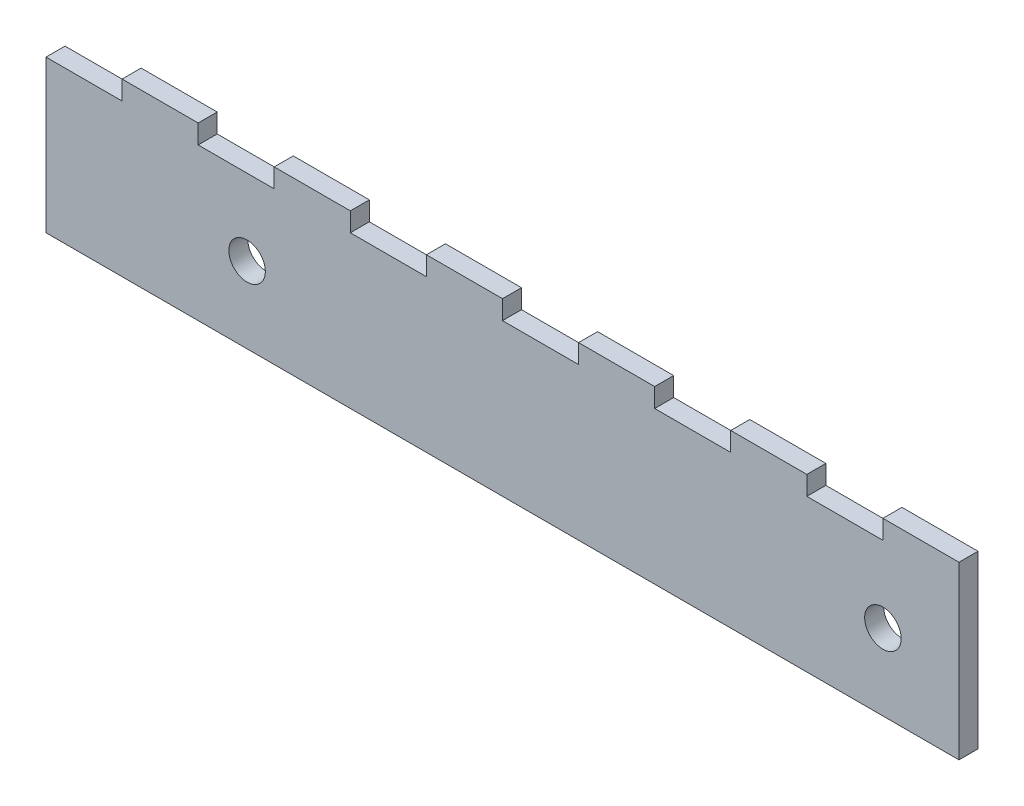
ISO-10303-21;
HEADER;
FILE_DESCRIPTION(('STEP AP214'),'2;1');
FILE_NAME('part.step','',(''),(''),'','','');
FILE_SCHEMA(('AUTOMOTIVE_DESIGN { 1 0 10303 214 1 1 1 1 }'));
ENDSEC;
DATA;
#1=APPLICATION_CONTEXT('core data for automotive mechanical design processes');
#2=APPLICATION_PROTOCOL_DEFINITION('international standard','automotive_design',2000,#1);
#3=PRODUCT_CONTEXT('',#1,'mechanical');
#4=PRODUCT('Part','Part','',(#3));
#5=PRODUCT_RELATED_PRODUCT_CATEGORY('part','',(#4));
#6=PRODUCT_DEFINITION_FORMATION('','',#4);
#7=PRODUCT_DEFINITION_CONTEXT('part definition',#1,'design');
#8=PRODUCT_DEFINITION('design','',#6,#7);
#9=PRODUCT_DEFINITION_SHAPE('','',#8);
#10=(LENGTH_UNIT() NAMED_UNIT(*) SI_UNIT(.MILLI.,.METRE.));
#11=(NAMED_UNIT(*) PLANE_ANGLE_UNIT() SI_UNIT($,.RADIAN.));
#12=(NAMED_UNIT(*) SI_UNIT($,.STERADIAN.) SOLID_ANGLE_UNIT());
#13=UNCERTAINTY_MEASURE_WITH_UNIT(LENGTH_MEASURE(1.E-05),#10,'distance_accuracy_value','');
#14=(GEOMETRIC_REPRESENTATION_CONTEXT(3) GLOBAL_UNCERTAINTY_ASSIGNED_CONTEXT((#13)) GLOBAL_UNIT_ASSIGNED_CONTEXT((#10,
#11,#12)) REPRESENTATION_CONTEXT('',''));
#15=CARTESIAN_POINT('',(0.,0.,0.));
#16=DIRECTION('',(0.,0.,1.));
#17=DIRECTION('',(1.,0.,0.));
#18=AXIS2_PLACEMENT_3D('',#15,#16,#17);
#19=CARTESIAN_POINT('',(0.,25.4,3.175));
#20=DIRECTION('',(0.,-1.,0.));
#21=DIRECTION('',(0.,0.,-1.));
#22=AXIS2_PLACEMENT_3D('',#19,#20,#21);
#23=PLANE('',#22);
#24=DIRECTION('',(0.,0.,1.));
#25=VECTOR('',#24,1.);
#26=CARTESIAN_POINT('',(12.7,25.4,8.88391561501073E-13));
#27=LINE('',#26,#25);
#28=CARTESIAN_POINT('',(12.7,25.4,8.88391561501073E-13));
#29=VERTEX_POINT('',#28);
#30=CARTESIAN_POINT('',(12.7,25.4,3.175));
#31=VERTEX_POINT('',#30);
#32=EDGE_CURVE('E425',#29,#31,#27,.T.);
#33=ORIENTED_EDGE('',*,*,#32,.F.);
#34=DIRECTION('',(-1.,0.,0.));
#35=VECTOR('',#34,1.);
#36=CARTESIAN_POINT('',(0.,25.4,0.));
#37=LINE('',#36,#35);
#38=CARTESIAN_POINT('',(0.,25.4,0.));
#39=VERTEX_POINT('',#38);
#40=EDGE_CURVE('E234',#29,#39,#37,.T.);
#41=ORIENTED_EDGE('',*,*,#40,.T.);
#42=DIRECTION('',(0.,0.,-1.));
#43=VECTOR('',#42,1.);
#44=CARTESIAN_POINT('',(0.,25.4,3.175));
#45=LINE('',#44,#43);
#46=CARTESIAN_POINT('',(0.,25.4,3.175));
#47=VERTEX_POINT('',#46);
#48=EDGE_CURVE('E391',#47,#39,#45,.T.);
#49=ORIENTED_EDGE('',*,*,#48,.F.);
#50=DIRECTION('',(-1.,0.,0.));
#51=VECTOR('',#50,1.);
#52=CARTESIAN_POINT('',(0.,25.4,3.175));
#53=LINE('',#52,#51);
#54=EDGE_CURVE('E52',#31,#47,#53,.T.);
#55=ORIENTED_EDGE('',*,*,#54,.F.);
#56=EDGE_LOOP('',(#33,#41,#49,#55));
#57=FACE_BOUND('',#56,.T.);
#58=ADVANCED_FACE('F37',(#57),#23,.F.);
#59=DIRECTION('',(0.,0.,-1.));
#60=VECTOR('',#59,1.);
#61=CARTESIAN_POINT('',(25.4,25.4,8.86836260066156E-13));
#62=LINE('',#61,#60);
#63=CARTESIAN_POINT('',(25.4,25.4,3.175));
#64=VERTEX_POINT('',#63);
#65=CARTESIAN_POINT('',(25.4,25.4,0.));
#66=VERTEX_POINT('',#65);
#67=EDGE_CURVE('E60',#64,#66,#62,.T.);
#68=ORIENTED_EDGE('',*,*,#67,.F.);
#69=CARTESIAN_POINT('',(38.1,25.4,3.175));
#70=VERTEX_POINT('',#69);
#71=EDGE_CURVE('E457',#70,#64,#53,.T.);
#72=ORIENTED_EDGE('',*,*,#71,.F.);
#73=DIRECTION('',(0.,0.,1.));
#74=VECTOR('',#73,1.);
#75=CARTESIAN_POINT('',(38.1,25.4,7.11024309487842E-13));
#76=LINE('',#75,#74);
#77=CARTESIAN_POINT('',(38.1,25.4,7.11024309487842E-13));
#78=VERTEX_POINT('',#77);
#79=EDGE_CURVE('E235',#78,#70,#76,.T.);
#80=ORIENTED_EDGE('',*,*,#79,.F.);
#81=EDGE_CURVE('E426',#78,#66,#37,.T.);
#82=ORIENTED_EDGE('',*,*,#81,.T.);
#83=EDGE_LOOP('',(#68,#72,#80,#82));
#84=FACE_BOUND('',#83,.T.);
#85=ADVANCED_FACE('F471',(#84),#23,.F.);
#86=DIRECTION('',(0.,0.,-1.));
#87=VECTOR('',#86,1.);
#88=CARTESIAN_POINT('',(50.8,25.4,7.09469008052925E-13));
#89=LINE('',#88,#87);
#90=CARTESIAN_POINT('',(50.8,25.4,3.175));
#91=VERTEX_POINT('',#90);
#92=CARTESIAN_POINT('',(50.8,25.4,0.));
#93=VERTEX_POINT('',#92);
#94=EDGE_CURVE('E238',#91,#93,#89,.T.);
#95=ORIENTED_EDGE('',*,*,#94,.F.);
#96=CARTESIAN_POINT('',(63.5,25.4,3.175));
#97=VERTEX_POINT('',#96);
#98=EDGE_CURVE('E454',#97,#91,#53,.T.);
#99=ORIENTED_EDGE('',*,*,#98,.F.);
#100=DIRECTION('',(0.,0.,1.));
#101=VECTOR('',#100,1.);
#102=CARTESIAN_POINT('',(63.5,25.4,5.33657057474611E-13));
#103=LINE('',#102,#101);
#104=CARTESIAN_POINT('',(63.5,25.4,5.33657057474611E-13));
#105=VERTEX_POINT('',#104);
#106=EDGE_CURVE('E267',#105,#97,#103,.T.);
#107=ORIENTED_EDGE('',*,*,#106,.F.);
#108=EDGE_CURVE('E427',#105,#93,#37,.T.);
#109=ORIENTED_EDGE('',*,*,#108,.T.);
#110=EDGE_LOOP('',(#95,#99,#107,#109));
#111=FACE_BOUND('',#110,.T.);
#112=ADVANCED_FACE('F483',(#111),#23,.F.);
#113=DIRECTION('',(0.,0.,-1.));
#114=VECTOR('',#113,1.);
#115=CARTESIAN_POINT('',(76.2,25.4,5.32101756039693E-13));
#116=LINE('',#115,#114);
#117=CARTESIAN_POINT('',(76.2,25.4,3.175));
#118=VERTEX_POINT('',#117);
#119=CARTESIAN_POINT('',(76.2,25.4,0.));
#120=VERTEX_POINT('',#119);
#121=EDGE_CURVE('E272',#118,#120,#116,.T.);
#122=ORIENTED_EDGE('',*,*,#121,.F.);
#123=CARTESIAN_POINT('',(88.9,25.4,3.175));
#124=VERTEX_POINT('',#123);
#125=EDGE_CURVE('E452',#124,#118,#53,.T.);
#126=ORIENTED_EDGE('',*,*,#125,.F.);
#127=DIRECTION('',(0.,0.,1.));
#128=VECTOR('',#127,1.);
#129=CARTESIAN_POINT('',(88.9,25.4,3.56289805461379E-13));
#130=LINE('',#129,#128);
#131=CARTESIAN_POINT('',(88.9,25.4,3.56289805461379E-13));
#132=VERTEX_POINT('',#131);
#133=EDGE_CURVE('E294',#132,#124,#130,.T.);
#134=ORIENTED_EDGE('',*,*,#133,.F.);
#135=EDGE_CURVE('E429',#132,#120,#37,.T.);
#136=ORIENTED_EDGE('',*,*,#135,.T.);
#137=EDGE_LOOP('',(#122,#126,#134,#136));
#138=FACE_BOUND('',#137,.T.);
#139=ADVANCED_FACE('F495',(#138),#23,.F.);
#140=DIRECTION('',(0.,0.,-1.));
#141=VECTOR('',#140,1.);
#142=CARTESIAN_POINT('',(101.6,25.4,3.54734504026462E-13));
#143=LINE('',#142,#141);
#144=CARTESIAN_POINT('',(101.6,25.4,3.175));
#145=VERTEX_POINT('',#144);
#146=CARTESIAN_POINT('',(101.6,25.4,0.));
#147=VERTEX_POINT('',#146);
#148=EDGE_CURVE('E299',#145,#147,#143,.T.);
#149=ORIENTED_EDGE('',*,*,#148,.F.);
#150=CARTESIAN_POINT('',(114.3,25.4,3.175));
#151=VERTEX_POINT('',#150);
#152=EDGE_CURVE('E392',#151,#145,#53,.T.);
#153=ORIENTED_EDGE('',*,*,#152,.F.);
#154=DIRECTION('',(0.,0.,1.));
#155=VECTOR('',#154,1.);
#156=CARTESIAN_POINT('',(114.3,25.4,1.78922553448148E-13));
#157=LINE('',#156,#155);
#158=CARTESIAN_POINT('',(114.3,25.4,1.78922553448148E-13));
#159=VERTEX_POINT('',#158);
#160=EDGE_CURVE('E321',#159,#151,#157,.T.);
#161=ORIENTED_EDGE('',*,*,#160,.F.);
#162=EDGE_CURVE('E400',#159,#147,#37,.T.);
#163=ORIENTED_EDGE('',*,*,#162,.T.);
#164=EDGE_LOOP('',(#149,#153,#161,#163));
#165=FACE_BOUND('',#164,.T.);
#166=ADVANCED_FACE('F436',(#165),#23,.F.);
#167=DIRECTION('',(0.,0.,-1.));
#168=VECTOR('',#167,1.);
#169=CARTESIAN_POINT('',(127.,25.4,1.77367252013231E-13));
#170=LINE('',#169,#168);
#171=CARTESIAN_POINT('',(127.,25.4,3.175));
#172=VERTEX_POINT('',#171);
#173=CARTESIAN_POINT('',(127.,25.4,0.));
#174=VERTEX_POINT('',#173);
#175=EDGE_CURVE('E326',#172,#174,#170,.T.);
#176=ORIENTED_EDGE('',*,*,#175,.F.);
#177=CARTESIAN_POINT('',(139.7,25.4,3.175));
#178=VERTEX_POINT('',#177);
#179=EDGE_CURVE('E388',#178,#172,#53,.T.);
#180=ORIENTED_EDGE('',*,*,#179,.F.);
#181=DIRECTION('',(0.,0.,1.));
#182=VECTOR('',#181,1.);
#183=CARTESIAN_POINT('',(139.7,25.4,0.));
#184=LINE('',#183,#182);
#185=CARTESIAN_POINT('',(139.7,25.4,0.));
#186=VERTEX_POINT('',#185);
#187=EDGE_CURVE('E348',#186,#178,#184,.T.);
#188=ORIENTED_EDGE('',*,*,#187,.F.);
#189=EDGE_CURVE('E384',#186,#174,#37,.T.);
#190=ORIENTED_EDGE('',*,*,#189,.T.);
#191=EDGE_LOOP('',(#176,#180,#188,#190));
#192=FACE_BOUND('',#191,.T.);
#193=ADVANCED_FACE('F511',(#192),#23,.F.);
#194=CARTESIAN_POINT('',(0.,0.,3.175));
#195=DIRECTION('',(0.,0.,-1.));
#196=DIRECTION('',(-1.,0.,0.));
#197=AXIS2_PLACEMENT_3D('',#194,#195,#196);
#198=PLANE('',#197);
#199=DIRECTION('',(0.,-1.,0.));
#200=VECTOR('',#199,1.);
#201=CARTESIAN_POINT('',(0.,0.,3.175));
#202=LINE('',#201,#200);
#203=CARTESIAN_POINT('',(0.,0.,3.175));
#204=VERTEX_POINT('',#203);
#205=EDGE_CURVE('E380',#47,#204,#202,.T.);
#206=ORIENTED_EDGE('',*,*,#205,.T.);
#207=DIRECTION('',(1.,0.,0.));
#208=VECTOR('',#207,1.);
#209=CARTESIAN_POINT('',(0.,0.,3.175));
#210=LINE('',#209,#208);
#211=CARTESIAN_POINT('',(152.4,0.,3.175));
#212=VERTEX_POINT('',#211);
#213=EDGE_CURVE('E383',#204,#212,#210,.T.);
#214=ORIENTED_EDGE('',*,*,#213,.T.);
#215=DIRECTION('',(0.,1.,0.));
#216=VECTOR('',#215,1.);
#217=CARTESIAN_POINT('',(152.4,0.,3.175));
#218=LINE('',#217,#216);
#219=CARTESIAN_POINT('',(152.4,28.575,3.175));
#220=VERTEX_POINT('',#219);
#221=EDGE_CURVE('E386',#212,#220,#218,.T.);
#222=ORIENTED_EDGE('',*,*,#221,.T.);
#223=DIRECTION('',(1.,0.,0.));
#224=VECTOR('',#223,1.);
#225=CARTESIAN_POINT('',(152.4,28.575,3.175));
#226=LINE('',#225,#224);
#227=CARTESIAN_POINT('',(139.7,28.575,3.175));
#228=VERTEX_POINT('',#227);
#229=EDGE_CURVE('E356',#228,#220,#226,.T.);
#230=ORIENTED_EDGE('',*,*,#229,.F.);
#231=DIRECTION('',(0.,-1.,0.));
#232=VECTOR('',#231,1.);
#233=CARTESIAN_POINT('',(139.7,28.575,3.175));
#234=LINE('',#233,#232);
#235=EDGE_CURVE('E359',#228,#178,#234,.T.);
#236=ORIENTED_EDGE('',*,*,#235,.T.);
#237=ORIENTED_EDGE('',*,*,#179,.T.);
#238=DIRECTION('',(0.,-1.,0.));
#239=VECTOR('',#238,1.);
#240=CARTESIAN_POINT('',(127.,28.575,3.17500000000018));
#241=LINE('',#240,#239);
#242=CARTESIAN_POINT('',(127.,28.575,3.17500000000018));
#243=VERTEX_POINT('',#242);
#244=EDGE_CURVE('E339',#243,#172,#241,.T.);
#245=ORIENTED_EDGE('',*,*,#244,.F.);
#246=DIRECTION('',(1.,0.,0.));
#247=VECTOR('',#246,1.);
#248=CARTESIAN_POINT('',(127.,28.575,3.17500000000018));
#249=LINE('',#248,#247);
#250=CARTESIAN_POINT('',(114.3,28.575,3.17500000000018));
#251=VERTEX_POINT('',#250);
#252=EDGE_CURVE('E328',#251,#243,#249,.T.);
#253=ORIENTED_EDGE('',*,*,#252,.F.);
#254=DIRECTION('',(0.,-1.,0.));
#255=VECTOR('',#254,1.);
#256=CARTESIAN_POINT('',(114.3,28.575,3.17500000000018));
#257=LINE('',#256,#255);
#258=EDGE_CURVE('E342',#251,#151,#257,.T.);
#259=ORIENTED_EDGE('',*,*,#258,.T.);
#260=ORIENTED_EDGE('',*,*,#152,.T.);
#261=DIRECTION('',(0.,-1.,0.));
#262=VECTOR('',#261,1.);
#263=CARTESIAN_POINT('',(101.6,28.575,3.17500000000035));
#264=LINE('',#263,#262);
#265=CARTESIAN_POINT('',(101.6,28.575,3.17500000000035));
#266=VERTEX_POINT('',#265);
#267=EDGE_CURVE('E312',#266,#145,#264,.T.);
#268=ORIENTED_EDGE('',*,*,#267,.F.);
#269=DIRECTION('',(1.,0.,0.));
#270=VECTOR('',#269,1.);
#271=CARTESIAN_POINT('',(101.6,28.575,3.17500000000035));
#272=LINE('',#271,#270);
#273=CARTESIAN_POINT('',(88.9,28.575,3.17500000000035));
#274=VERTEX_POINT('',#273);
#275=EDGE_CURVE('E301',#274,#266,#272,.T.);
#276=ORIENTED_EDGE('',*,*,#275,.F.);
#277=DIRECTION('',(0.,-1.,0.));
#278=VECTOR('',#277,1.);
#279=CARTESIAN_POINT('',(88.9,28.575,3.17500000000035));
#280=LINE('',#279,#278);
#281=EDGE_CURVE('E315',#274,#124,#280,.T.);
#282=ORIENTED_EDGE('',*,*,#281,.T.);
#283=ORIENTED_EDGE('',*,*,#125,.T.);
#284=DIRECTION('',(0.,-1.,0.));
#285=VECTOR('',#284,1.);
#286=CARTESIAN_POINT('',(76.2,28.575,3.17500000000053));
#287=LINE('',#286,#285);
#288=CARTESIAN_POINT('',(76.2,28.575,3.17500000000053));
#289=VERTEX_POINT('',#288);
#290=EDGE_CURVE('E285',#289,#118,#287,.T.);
#291=ORIENTED_EDGE('',*,*,#290,.F.);
#292=DIRECTION('',(1.,0.,0.));
#293=VECTOR('',#292,1.);
#294=CARTESIAN_POINT('',(76.2,28.575,3.17500000000053));
#295=LINE('',#294,#293);
#296=CARTESIAN_POINT('',(63.5,28.575,3.17500000000053));
#297=VERTEX_POINT('',#296);
#298=EDGE_CURVE('E274',#297,#289,#295,.T.);
#299=ORIENTED_EDGE('',*,*,#298,.F.);
#300=DIRECTION('',(0.,-1.,0.));
#301=VECTOR('',#300,1.);
#302=CARTESIAN_POINT('',(63.5,28.575,3.17500000000053));
#303=LINE('',#302,#301);
#304=EDGE_CURVE('E288',#297,#97,#303,.T.);
#305=ORIENTED_EDGE('',*,*,#304,.T.);
#306=ORIENTED_EDGE('',*,*,#98,.T.);
#307=DIRECTION('',(0.,-1.,0.));
#308=VECTOR('',#307,1.);
#309=CARTESIAN_POINT('',(50.8,28.575,3.17500000000071));
#310=LINE('',#309,#308);
#311=CARTESIAN_POINT('',(50.8,28.575,3.17500000000071));
#312=VERTEX_POINT('',#311);
#313=EDGE_CURVE('E258',#312,#91,#310,.T.);
#314=ORIENTED_EDGE('',*,*,#313,.F.);
#315=DIRECTION('',(1.,0.,0.));
#316=VECTOR('',#315,1.);
#317=CARTESIAN_POINT('',(50.8,28.575,3.17500000000071));
#318=LINE('',#317,#316);
#319=CARTESIAN_POINT('',(38.1,28.575,3.17500000000071));
#320=VERTEX_POINT('',#319);
#321=EDGE_CURVE('E249',#320,#312,#318,.T.);
#322=ORIENTED_EDGE('',*,*,#321,.F.);
#323=DIRECTION('',(0.,-1.,0.));
#324=VECTOR('',#323,1.);
#325=CARTESIAN_POINT('',(38.1,28.575,3.17500000000071));
#326=LINE('',#325,#324);
#327=EDGE_CURVE('E261',#320,#70,#326,.T.);
#328=ORIENTED_EDGE('',*,*,#327,.T.);
#329=ORIENTED_EDGE('',*,*,#71,.T.);
#330=DIRECTION('',(0.,-1.,0.));
#331=VECTOR('',#330,1.);
#332=CARTESIAN_POINT('',(25.4,28.575,3.17500000000089));
#333=LINE('',#332,#331);
#334=CARTESIAN_POINT('',(25.4,28.575,3.17500000000089));
#335=VERTEX_POINT('',#334);
#336=EDGE_CURVE('E240',#335,#64,#333,.T.);
#337=ORIENTED_EDGE('',*,*,#336,.F.);
#338=DIRECTION('',(1.,0.,0.));
#339=VECTOR('',#338,1.);
#340=CARTESIAN_POINT('',(25.4,28.575,3.17500000000089));
#341=LINE('',#340,#339);
#342=CARTESIAN_POINT('',(12.7,28.575,3.17500000000089));
#343=VERTEX_POINT('',#342);
#344=EDGE_CURVE('E220',#343,#335,#341,.T.);
#345=ORIENTED_EDGE('',*,*,#344,.F.);
#346=DIRECTION('',(0.,-1.,0.));
#347=VECTOR('',#346,1.);
#348=CARTESIAN_POINT('',(12.7,28.575,3.17500000000089));
#349=LINE('',#348,#347);
#350=EDGE_CURVE('E217',#343,#31,#349,.T.);
#351=ORIENTED_EDGE('',*,*,#350,.T.);
#352=ORIENTED_EDGE('',*,*,#54,.T.);
#353=EDGE_LOOP('',(#206,#214,#222,#230,#236,#237,#245,#253,#259,#260,#268,#276,#282,#283,#291,
#299,#305,#306,#314,#322,#328,#329,#337,#345,#351,#352));
#354=FACE_BOUND('',#353,.T.);
#355=CARTESIAN_POINT('',(139.7,12.7,3.175));
#356=DIRECTION('',(0.,0.,1.));
#357=DIRECTION('',(1.,0.,0.));
#358=AXIS2_PLACEMENT_3D('',#355,#356,#357);
#359=CIRCLE('',#358,3.04799999999998);
#360=CARTESIAN_POINT('',(142.748,12.7,3.175));
#361=VERTEX_POINT('',#360);
#362=EDGE_CURVE('E374',#361,#361,#359,.T.);
#363=ORIENTED_EDGE('',*,*,#362,.F.);
#364=EDGE_LOOP('',(#363));
#365=FACE_BOUND('',#364,.T.);
#366=CARTESIAN_POINT('',(33.56356,12.7,3.175));
#367=DIRECTION('',(0.,0.,1.));
#368=DIRECTION('',(1.,0.,0.));
#369=AXIS2_PLACEMENT_3D('',#366,#367,#368);
#370=CIRCLE('',#369,3.048);
#371=CARTESIAN_POINT('',(36.61156,12.7,3.175));
#372=VERTEX_POINT('',#371);
#373=EDGE_CURVE('E368',#372,#372,#370,.T.);
#374=ORIENTED_EDGE('',*,*,#373,.F.);
#375=EDGE_LOOP('',(#374));
#376=FACE_BOUND('',#375,.T.);
#377=ADVANCED_FACE('F419',(#354,#365,#376),#198,.F.);
#378=CARTESIAN_POINT('',(0.,0.,0.));
#379=DIRECTION('',(0.,0.,-1.));
#380=DIRECTION('',(-1.,0.,0.));
#381=AXIS2_PLACEMENT_3D('',#378,#379,#380);
#382=PLANE('',#381);
#383=CARTESIAN_POINT('',(139.7,12.7,0.));
#384=DIRECTION('',(0.,0.,1.));
#385=DIRECTION('',(1.,0.,0.));
#386=AXIS2_PLACEMENT_3D('',#383,#384,#385);
#387=CIRCLE('',#386,3.04799999999998);
#388=CARTESIAN_POINT('',(142.748,12.7,0.));
#389=VERTEX_POINT('',#388);
#390=EDGE_CURVE('E371',#389,#389,#387,.T.);
#391=ORIENTED_EDGE('',*,*,#390,.T.);
#392=EDGE_LOOP('',(#391));
#393=FACE_BOUND('',#392,.T.);
#394=DIRECTION('',(0.,-1.,0.));
#395=VECTOR('',#394,1.);
#396=CARTESIAN_POINT('',(0.,0.,0.));
#397=LINE('',#396,#395);
#398=CARTESIAN_POINT('',(0.,0.,0.));
#399=VERTEX_POINT('',#398);
#400=EDGE_CURVE('E377',#39,#399,#397,.T.);
#401=ORIENTED_EDGE('',*,*,#400,.F.);
#402=ORIENTED_EDGE('',*,*,#40,.F.);
#403=DIRECTION('',(0.,-1.,0.));
#404=VECTOR('',#403,1.);
#405=CARTESIAN_POINT('',(12.7,28.575,8.88391561501073E-13));
#406=LINE('',#405,#404);
#407=CARTESIAN_POINT('',(12.7,28.575,8.88391561501073E-13));
#408=VERTEX_POINT('',#407);
#409=EDGE_CURVE('E215',#408,#29,#406,.T.);
#410=ORIENTED_EDGE('',*,*,#409,.F.);
#411=DIRECTION('',(-1.,0.,0.));
#412=VECTOR('',#411,1.);
#413=CARTESIAN_POINT('',(25.4,28.575,8.86836260066156E-13));
#414=LINE('',#413,#412);
#415=CARTESIAN_POINT('',(25.4,28.575,8.86836260066156E-13));
#416=VERTEX_POINT('',#415);
#417=EDGE_CURVE('E221',#416,#408,#414,.T.);
#418=ORIENTED_EDGE('',*,*,#417,.F.);
#419=DIRECTION('',(0.,-1.,0.));
#420=VECTOR('',#419,1.);
#421=CARTESIAN_POINT('',(25.4,28.575,8.86836260066156E-13));
#422=LINE('',#421,#420);
#423=EDGE_CURVE('E462',#416,#66,#422,.T.);
#424=ORIENTED_EDGE('',*,*,#423,.T.);
#425=ORIENTED_EDGE('',*,*,#81,.F.);
#426=DIRECTION('',(0.,-1.,0.));
#427=VECTOR('',#426,1.);
#428=CARTESIAN_POINT('',(38.1,28.575,7.11024309487842E-13));
#429=LINE('',#428,#427);
#430=CARTESIAN_POINT('',(38.1,28.575,7.11024309487842E-13));
#431=VERTEX_POINT('',#430);
#432=EDGE_CURVE('E264',#431,#78,#429,.T.);
#433=ORIENTED_EDGE('',*,*,#432,.F.);
#434=DIRECTION('',(-1.,0.,0.));
#435=VECTOR('',#434,1.);
#436=CARTESIAN_POINT('',(50.8,28.575,7.09469008052925E-13));
#437=LINE('',#436,#435);
#438=CARTESIAN_POINT('',(50.8,28.575,7.09469008052925E-13));
#439=VERTEX_POINT('',#438);
#440=EDGE_CURVE('E244',#439,#431,#437,.T.);
#441=ORIENTED_EDGE('',*,*,#440,.F.);
#442=DIRECTION('',(0.,-1.,0.));
#443=VECTOR('',#442,1.);
#444=CARTESIAN_POINT('',(50.8,28.575,7.09469008052925E-13));
#445=LINE('',#444,#443);
#446=EDGE_CURVE('E252',#439,#93,#445,.T.);
#447=ORIENTED_EDGE('',*,*,#446,.T.);
#448=ORIENTED_EDGE('',*,*,#108,.F.);
#449=DIRECTION('',(0.,-1.,0.));
#450=VECTOR('',#449,1.);
#451=CARTESIAN_POINT('',(63.5,28.575,5.33657057474611E-13));
#452=LINE('',#451,#450);
#453=CARTESIAN_POINT('',(63.5,28.575,5.33657057474611E-13));
#454=VERTEX_POINT('',#453);
#455=EDGE_CURVE('E291',#454,#105,#452,.T.);
#456=ORIENTED_EDGE('',*,*,#455,.F.);
#457=DIRECTION('',(-1.,0.,0.));
#458=VECTOR('',#457,1.);
#459=CARTESIAN_POINT('',(76.2,28.575,5.32101756039693E-13));
#460=LINE('',#459,#458);
#461=CARTESIAN_POINT('',(76.2,28.575,5.32101756039693E-13));
#462=VERTEX_POINT('',#461);
#463=EDGE_CURVE('E268',#462,#454,#460,.T.);
#464=ORIENTED_EDGE('',*,*,#463,.F.);
#465=DIRECTION('',(0.,-1.,0.));
#466=VECTOR('',#465,1.);
#467=CARTESIAN_POINT('',(76.2,28.575,5.32101756039693E-13));
#468=LINE('',#467,#466);
#469=EDGE_CURVE('E278',#462,#120,#468,.T.);
#470=ORIENTED_EDGE('',*,*,#469,.T.);
#471=ORIENTED_EDGE('',*,*,#135,.F.);
#472=DIRECTION('',(0.,-1.,0.));
#473=VECTOR('',#472,1.);
#474=CARTESIAN_POINT('',(88.9,28.575,3.56289805461379E-13));
#475=LINE('',#474,#473);
#476=CARTESIAN_POINT('',(88.9,28.575,3.56289805461379E-13));
#477=VERTEX_POINT('',#476);
#478=EDGE_CURVE('E318',#477,#132,#475,.T.);
#479=ORIENTED_EDGE('',*,*,#478,.F.);
#480=DIRECTION('',(-1.,0.,0.));
#481=VECTOR('',#480,1.);
#482=CARTESIAN_POINT('',(101.6,28.575,3.54734504026462E-13));
#483=LINE('',#482,#481);
#484=CARTESIAN_POINT('',(101.6,28.575,3.54734504026462E-13));
#485=VERTEX_POINT('',#484);
#486=EDGE_CURVE('E295',#485,#477,#483,.T.);
#487=ORIENTED_EDGE('',*,*,#486,.F.);
#488=DIRECTION('',(0.,-1.,0.));
#489=VECTOR('',#488,1.);
#490=CARTESIAN_POINT('',(101.6,28.575,3.54734504026462E-13));
#491=LINE('',#490,#489);
#492=EDGE_CURVE('E305',#485,#147,#491,.T.);
#493=ORIENTED_EDGE('',*,*,#492,.T.);
#494=ORIENTED_EDGE('',*,*,#162,.F.);
#495=DIRECTION('',(0.,-1.,0.));
#496=VECTOR('',#495,1.);
#497=CARTESIAN_POINT('',(114.3,28.575,1.78922553448148E-13));
#498=LINE('',#497,#496);
#499=CARTESIAN_POINT('',(114.3,28.575,1.78922553448148E-13));
#500=VERTEX_POINT('',#499);
#501=EDGE_CURVE('E345',#500,#159,#498,.T.);
#502=ORIENTED_EDGE('',*,*,#501,.F.);
#503=DIRECTION('',(-1.,0.,0.));
#504=VECTOR('',#503,1.);
#505=CARTESIAN_POINT('',(127.,28.575,1.77367252013231E-13));
#506=LINE('',#505,#504);
#507=CARTESIAN_POINT('',(127.,28.575,1.77367252013231E-13));
#508=VERTEX_POINT('',#507);
#509=EDGE_CURVE('E322',#508,#500,#506,.T.);
#510=ORIENTED_EDGE('',*,*,#509,.F.);
#511=DIRECTION('',(0.,-1.,0.));
#512=VECTOR('',#511,1.);
#513=CARTESIAN_POINT('',(127.,28.575,1.77367252013231E-13));
#514=LINE('',#513,#512);
#515=EDGE_CURVE('E332',#508,#174,#514,.T.);
#516=ORIENTED_EDGE('',*,*,#515,.T.);
#517=ORIENTED_EDGE('',*,*,#189,.F.);
#518=DIRECTION('',(0.,-1.,0.));
#519=VECTOR('',#518,1.);
#520=CARTESIAN_POINT('',(139.7,28.575,0.));
#521=LINE('',#520,#519);
#522=CARTESIAN_POINT('',(139.7,28.575,0.));
#523=VERTEX_POINT('',#522);
#524=EDGE_CURVE('E364',#523,#186,#521,.T.);
#525=ORIENTED_EDGE('',*,*,#524,.F.);
#526=DIRECTION('',(-1.,0.,0.));
#527=VECTOR('',#526,1.);
#528=CARTESIAN_POINT('',(152.4,28.575,0.));
#529=LINE('',#528,#527);
#530=CARTESIAN_POINT('',(152.4,28.575,0.));
#531=VERTEX_POINT('',#530);
#532=EDGE_CURVE('E352',#531,#523,#529,.T.);
#533=ORIENTED_EDGE('',*,*,#532,.F.);
#534=DIRECTION('',(0.,1.,0.));
#535=VECTOR('',#534,1.);
#536=CARTESIAN_POINT('',(152.4,0.,0.));
#537=LINE('',#536,#535);
#538=CARTESIAN_POINT('',(152.4,0.,0.));
#539=VERTEX_POINT('',#538);
#540=EDGE_CURVE('E397',#539,#531,#537,.T.);
#541=ORIENTED_EDGE('',*,*,#540,.F.);
#542=DIRECTION('',(1.,0.,0.));
#543=VECTOR('',#542,1.);
#544=CARTESIAN_POINT('',(0.,0.,0.));
#545=LINE('',#544,#543);
#546=EDGE_CURVE('E395',#399,#539,#545,.T.);
#547=ORIENTED_EDGE('',*,*,#546,.F.);
#548=EDGE_LOOP('',(#401,#402,#410,#418,#424,#425,#433,#441,#447,#448,#456,#464,#470,#471,#479,
#487,#493,#494,#502,#510,#516,#517,#525,#533,#541,#547));
#549=FACE_BOUND('',#548,.T.);
#550=CARTESIAN_POINT('',(33.56356,12.7,0.));
#551=DIRECTION('',(0.,0.,1.));
#552=DIRECTION('',(1.,0.,0.));
#553=AXIS2_PLACEMENT_3D('',#550,#551,#552);
#554=CIRCLE('',#553,3.048);
#555=CARTESIAN_POINT('',(36.61156,12.7,0.));
#556=VERTEX_POINT('',#555);
#557=EDGE_CURVE('E367',#556,#556,#554,.T.);
#558=ORIENTED_EDGE('',*,*,#557,.T.);
#559=EDGE_LOOP('',(#558));
#560=FACE_BOUND('',#559,.T.);
#561=ADVANCED_FACE('F232',(#393,#549,#560),#382,.T.);
#562=CARTESIAN_POINT('',(0.,0.,3.175));
#563=DIRECTION('',(1.,0.,0.));
#564=DIRECTION('',(0.,0.,-1.));
#565=AXIS2_PLACEMENT_3D('',#562,#563,#564);
#566=PLANE('',#565);
#567=ORIENTED_EDGE('',*,*,#400,.T.);
#568=DIRECTION('',(0.,0.,-1.));
#569=VECTOR('',#568,1.);
#570=CARTESIAN_POINT('',(0.,0.,3.175));
#571=LINE('',#570,#569);
#572=EDGE_CURVE('E11',#204,#399,#571,.T.);
#573=ORIENTED_EDGE('',*,*,#572,.F.);
#574=ORIENTED_EDGE('',*,*,#205,.F.);
#575=ORIENTED_EDGE('',*,*,#48,.T.);
#576=EDGE_LOOP('',(#567,#573,#574,#575));
#577=FACE_BOUND('',#576,.T.);
#578=ADVANCED_FACE('F39',(#577),#566,.F.);
#579=CARTESIAN_POINT('',(0.,0.,3.175));
#580=DIRECTION('',(0.,1.,0.));
#581=DIRECTION('',(0.,0.,1.));
#582=AXIS2_PLACEMENT_3D('',#579,#580,#581);
#583=PLANE('',#582);
#584=ORIENTED_EDGE('',*,*,#546,.T.);
#585=DIRECTION('',(0.,0.,-1.));
#586=VECTOR('',#585,1.);
#587=CARTESIAN_POINT('',(152.4,0.,3.175));
#588=LINE('',#587,#586);
#589=EDGE_CURVE('E45',#212,#539,#588,.T.);
#590=ORIENTED_EDGE('',*,*,#589,.F.);
#591=ORIENTED_EDGE('',*,*,#213,.F.);
#592=ORIENTED_EDGE('',*,*,#572,.T.);
#593=EDGE_LOOP('',(#584,#590,#591,#592));
#594=FACE_BOUND('',#593,.T.);
#595=ADVANCED_FACE('F423',(#594),#583,.F.);
#596=CARTESIAN_POINT('',(152.4,0.,3.175));
#597=DIRECTION('',(-1.,0.,0.));
#598=DIRECTION('',(0.,0.,1.));
#599=AXIS2_PLACEMENT_3D('',#596,#597,#598);
#600=PLANE('',#599);
#601=ORIENTED_EDGE('',*,*,#540,.T.);
#602=DIRECTION('',(0.,0.,-1.));
#603=VECTOR('',#602,1.);
#604=CARTESIAN_POINT('',(152.4,28.575,0.));
#605=LINE('',#604,#603);
#606=EDGE_CURVE('E349',#220,#531,#605,.T.);
#607=ORIENTED_EDGE('',*,*,#606,.F.);
#608=ORIENTED_EDGE('',*,*,#221,.F.);
#609=ORIENTED_EDGE('',*,*,#589,.T.);
#610=EDGE_LOOP('',(#601,#607,#608,#609));
#611=FACE_BOUND('',#610,.T.);
#612=ADVANCED_FACE('F407',(#611),#600,.F.);
#613=CARTESIAN_POINT('',(139.7,12.7,3.175));
#614=DIRECTION('',(0.,0.,-1.));
#615=DIRECTION('',(-1.,0.,0.));
#616=AXIS2_PLACEMENT_3D('',#613,#614,#615);
#617=CYLINDRICAL_SURFACE('',#616,3.04799999999998);
#618=ORIENTED_EDGE('',*,*,#362,.T.);
#619=EDGE_LOOP('',(#618));
#620=FACE_BOUND('',#619,.T.);
#621=ORIENTED_EDGE('',*,*,#390,.F.);
#622=EDGE_LOOP('',(#621));
#623=FACE_BOUND('',#622,.T.);
#624=ADVANCED_FACE('F541',(#620,#623),#617,.F.);
#625=CARTESIAN_POINT('',(33.56356,12.7,3.175));
#626=DIRECTION('',(0.,0.,-1.));
#627=DIRECTION('',(-1.,0.,0.));
#628=AXIS2_PLACEMENT_3D('',#625,#626,#627);
#629=CYLINDRICAL_SURFACE('',#628,3.048);
#630=ORIENTED_EDGE('',*,*,#373,.T.);
#631=EDGE_LOOP('',(#630));
#632=FACE_BOUND('',#631,.T.);
#633=ORIENTED_EDGE('',*,*,#557,.F.);
#634=EDGE_LOOP('',(#633));
#635=FACE_BOUND('',#634,.T.);
#636=ADVANCED_FACE('F534',(#632,#635),#629,.F.);
#637=CARTESIAN_POINT('',(139.7,28.575,0.));
#638=DIRECTION('',(1.,0.,0.));
#639=DIRECTION('',(0.,0.,-1.));
#640=AXIS2_PLACEMENT_3D('',#637,#638,#639);
#641=PLANE('',#640);
#642=ORIENTED_EDGE('',*,*,#187,.T.);
#643=ORIENTED_EDGE('',*,*,#235,.F.);
#644=DIRECTION('',(0.,0.,1.));
#645=VECTOR('',#644,1.);
#646=CARTESIAN_POINT('',(139.7,28.575,0.));
#647=LINE('',#646,#645);
#648=EDGE_CURVE('E354',#523,#228,#647,.T.);
#649=ORIENTED_EDGE('',*,*,#648,.F.);
#650=ORIENTED_EDGE('',*,*,#524,.T.);
#651=EDGE_LOOP('',(#642,#643,#649,#650));
#652=FACE_BOUND('',#651,.T.);
#653=ADVANCED_FACE('F532',(#652),#641,.F.);
#654=CARTESIAN_POINT('',(0.,28.575,0.));
#655=DIRECTION('',(0.,-1.,0.));
#656=DIRECTION('',(0.,0.,-1.));
#657=AXIS2_PLACEMENT_3D('',#654,#655,#656);
#658=PLANE('',#657);
#659=ORIENTED_EDGE('',*,*,#606,.T.);
#660=ORIENTED_EDGE('',*,*,#532,.T.);
#661=ORIENTED_EDGE('',*,*,#648,.T.);
#662=ORIENTED_EDGE('',*,*,#229,.T.);
#663=EDGE_LOOP('',(#659,#660,#661,#662));
#664=FACE_BOUND('',#663,.T.);
#665=ADVANCED_FACE('F415',(#664),#658,.F.);
#666=CARTESIAN_POINT('',(114.3,28.575,1.78922553448148E-13));
#667=DIRECTION('',(1.,0.,0.));
#668=DIRECTION('',(0.,0.,-1.));
#669=AXIS2_PLACEMENT_3D('',#666,#667,#668);
#670=PLANE('',#669);
#671=ORIENTED_EDGE('',*,*,#160,.T.);
#672=ORIENTED_EDGE('',*,*,#258,.F.);
#673=DIRECTION('',(0.,0.,1.));
#674=VECTOR('',#673,1.);
#675=CARTESIAN_POINT('',(114.3,28.575,1.78922553448148E-13));
#676=LINE('',#675,#674);
#677=EDGE_CURVE('E325',#500,#251,#676,.T.);
#678=ORIENTED_EDGE('',*,*,#677,.F.);
#679=ORIENTED_EDGE('',*,*,#501,.T.);
#680=EDGE_LOOP('',(#671,#672,#678,#679));
#681=FACE_BOUND('',#680,.T.);
#682=ADVANCED_FACE('F530',(#681),#670,.F.);
#683=CARTESIAN_POINT('',(127.,28.575,1.77367252013231E-13));
#684=DIRECTION('',(-1.,0.,0.));
#685=DIRECTION('',(0.,0.,1.));
#686=AXIS2_PLACEMENT_3D('',#683,#684,#685);
#687=PLANE('',#686);
#688=ORIENTED_EDGE('',*,*,#175,.T.);
#689=ORIENTED_EDGE('',*,*,#515,.F.);
#690=DIRECTION('',(0.,0.,-1.));
#691=VECTOR('',#690,1.);
#692=CARTESIAN_POINT('',(127.,28.575,1.77367252013231E-13));
#693=LINE('',#692,#691);
#694=EDGE_CURVE('E330',#243,#508,#693,.T.);
#695=ORIENTED_EDGE('',*,*,#694,.F.);
#696=ORIENTED_EDGE('',*,*,#244,.T.);
#697=EDGE_LOOP('',(#688,#689,#695,#696));
#698=FACE_BOUND('',#697,.T.);
#699=ADVANCED_FACE('F506',(#698),#687,.F.);
#700=CARTESIAN_POINT('',(0.,28.575,0.));
#701=DIRECTION('',(0.,1.,0.));
#702=DIRECTION('',(0.,0.,1.));
#703=AXIS2_PLACEMENT_3D('',#700,#701,#702);
#704=PLANE('',#703);
#705=ORIENTED_EDGE('',*,*,#509,.T.);
#706=ORIENTED_EDGE('',*,*,#677,.T.);
#707=ORIENTED_EDGE('',*,*,#252,.T.);
#708=ORIENTED_EDGE('',*,*,#694,.T.);
#709=EDGE_LOOP('',(#705,#706,#707,#708));
#710=FACE_BOUND('',#709,.T.);
#711=ADVANCED_FACE('F499',(#710),#704,.T.);
#712=CARTESIAN_POINT('',(88.9,28.575,3.56289805461379E-13));
#713=DIRECTION('',(1.,0.,0.));
#714=DIRECTION('',(0.,0.,-1.));
#715=AXIS2_PLACEMENT_3D('',#712,#713,#714);
#716=PLANE('',#715);
#717=ORIENTED_EDGE('',*,*,#133,.T.);
#718=ORIENTED_EDGE('',*,*,#281,.F.);
#719=DIRECTION('',(0.,0.,1.));
#720=VECTOR('',#719,1.);
#721=CARTESIAN_POINT('',(88.9,28.575,3.56289805461379E-13));
#722=LINE('',#721,#720);
#723=EDGE_CURVE('E298',#477,#274,#722,.T.);
#724=ORIENTED_EDGE('',*,*,#723,.F.);
#725=ORIENTED_EDGE('',*,*,#478,.T.);
#726=EDGE_LOOP('',(#717,#718,#724,#725));
#727=FACE_BOUND('',#726,.T.);
#728=ADVANCED_FACE('F497',(#727),#716,.F.);
#729=CARTESIAN_POINT('',(101.6,28.575,3.54734504026462E-13));
#730=DIRECTION('',(-1.,0.,0.));
#731=DIRECTION('',(0.,0.,1.));
#732=AXIS2_PLACEMENT_3D('',#729,#730,#731);
#733=PLANE('',#732);
#734=ORIENTED_EDGE('',*,*,#148,.T.);
#735=ORIENTED_EDGE('',*,*,#492,.F.);
#736=DIRECTION('',(0.,0.,-1.));
#737=VECTOR('',#736,1.);
#738=CARTESIAN_POINT('',(101.6,28.575,3.54734504026462E-13));
#739=LINE('',#738,#737);
#740=EDGE_CURVE('E303',#266,#485,#739,.T.);
#741=ORIENTED_EDGE('',*,*,#740,.F.);
#742=ORIENTED_EDGE('',*,*,#267,.T.);
#743=EDGE_LOOP('',(#734,#735,#741,#742));
#744=FACE_BOUND('',#743,.T.);
#745=ADVANCED_FACE('F441',(#744),#733,.F.);
#746=CARTESIAN_POINT('',(0.,28.575,0.));
#747=DIRECTION('',(0.,1.,0.));
#748=DIRECTION('',(0.,0.,1.));
#749=AXIS2_PLACEMENT_3D('',#746,#747,#748);
#750=PLANE('',#749);
#751=ORIENTED_EDGE('',*,*,#486,.T.);
#752=ORIENTED_EDGE('',*,*,#723,.T.);
#753=ORIENTED_EDGE('',*,*,#275,.T.);
#754=ORIENTED_EDGE('',*,*,#740,.T.);
#755=EDGE_LOOP('',(#751,#752,#753,#754));
#756=FACE_BOUND('',#755,.T.);
#757=ADVANCED_FACE('F447',(#756),#750,.T.);
#758=CARTESIAN_POINT('',(63.5,28.575,5.33657057474611E-13));
#759=DIRECTION('',(1.,0.,0.));
#760=DIRECTION('',(0.,0.,-1.));
#761=AXIS2_PLACEMENT_3D('',#758,#759,#760);
#762=PLANE('',#761);
#763=ORIENTED_EDGE('',*,*,#106,.T.);
#764=ORIENTED_EDGE('',*,*,#304,.F.);
#765=DIRECTION('',(0.,0.,1.));
#766=VECTOR('',#765,1.);
#767=CARTESIAN_POINT('',(63.5,28.575,5.33657057474611E-13));
#768=LINE('',#767,#766);
#769=EDGE_CURVE('E271',#454,#297,#768,.T.);
#770=ORIENTED_EDGE('',*,*,#769,.F.);
#771=ORIENTED_EDGE('',*,*,#455,.T.);
#772=EDGE_LOOP('',(#763,#764,#770,#771));
#773=FACE_BOUND('',#772,.T.);
#774=ADVANCED_FACE('F486',(#773),#762,.F.);
#775=CARTESIAN_POINT('',(76.2,28.575,5.32101756039693E-13));
#776=DIRECTION('',(-1.,0.,0.));
#777=DIRECTION('',(0.,0.,1.));
#778=AXIS2_PLACEMENT_3D('',#775,#776,#777);
#779=PLANE('',#778);
#780=ORIENTED_EDGE('',*,*,#121,.T.);
#781=ORIENTED_EDGE('',*,*,#469,.F.);
#782=DIRECTION('',(0.,0.,-1.));
#783=VECTOR('',#782,1.);
#784=CARTESIAN_POINT('',(76.2,28.575,5.32101756039693E-13));
#785=LINE('',#784,#783);
#786=EDGE_CURVE('E276',#289,#462,#785,.T.);
#787=ORIENTED_EDGE('',*,*,#786,.F.);
#788=ORIENTED_EDGE('',*,*,#290,.T.);
#789=EDGE_LOOP('',(#780,#781,#787,#788));
#790=FACE_BOUND('',#789,.T.);
#791=ADVANCED_FACE('F494',(#790),#779,.F.);
#792=CARTESIAN_POINT('',(0.,28.575,0.));
#793=DIRECTION('',(0.,1.,0.));
#794=DIRECTION('',(0.,0.,1.));
#795=AXIS2_PLACEMENT_3D('',#792,#793,#794);
#796=PLANE('',#795);
#797=ORIENTED_EDGE('',*,*,#463,.T.);
#798=ORIENTED_EDGE('',*,*,#769,.T.);
#799=ORIENTED_EDGE('',*,*,#298,.T.);
#800=ORIENTED_EDGE('',*,*,#786,.T.);
#801=EDGE_LOOP('',(#797,#798,#799,#800));
#802=FACE_BOUND('',#801,.T.);
#803=ADVANCED_FACE('F490',(#802),#796,.T.);
#804=CARTESIAN_POINT('',(38.1,28.575,7.11024309487842E-13));
#805=DIRECTION('',(1.,0.,0.));
#806=DIRECTION('',(0.,0.,-1.));
#807=AXIS2_PLACEMENT_3D('',#804,#805,#806);
#808=PLANE('',#807);
#809=ORIENTED_EDGE('',*,*,#79,.T.);
#810=ORIENTED_EDGE('',*,*,#327,.F.);
#811=DIRECTION('',(0.,0.,1.));
#812=VECTOR('',#811,1.);
#813=CARTESIAN_POINT('',(38.1,28.575,7.11024309487842E-13));
#814=LINE('',#813,#812);
#815=EDGE_CURVE('E247',#431,#320,#814,.T.);
#816=ORIENTED_EDGE('',*,*,#815,.F.);
#817=ORIENTED_EDGE('',*,*,#432,.T.);
#818=EDGE_LOOP('',(#809,#810,#816,#817));
#819=FACE_BOUND('',#818,.T.);
#820=ADVANCED_FACE('F474',(#819),#808,.F.);
#821=CARTESIAN_POINT('',(50.8,28.575,7.09469008052925E-13));
#822=DIRECTION('',(-1.,0.,0.));
#823=DIRECTION('',(0.,0.,1.));
#824=AXIS2_PLACEMENT_3D('',#821,#822,#823);
#825=PLANE('',#824);
#826=ORIENTED_EDGE('',*,*,#94,.T.);
#827=ORIENTED_EDGE('',*,*,#446,.F.);
#828=DIRECTION('',(0.,0.,-1.));
#829=VECTOR('',#828,1.);
#830=CARTESIAN_POINT('',(50.8,28.575,7.09469008052925E-13));
#831=LINE('',#830,#829);
#832=EDGE_CURVE('E251',#312,#439,#831,.T.);
#833=ORIENTED_EDGE('',*,*,#832,.F.);
#834=ORIENTED_EDGE('',*,*,#313,.T.);
#835=EDGE_LOOP('',(#826,#827,#833,#834));
#836=FACE_BOUND('',#835,.T.);
#837=ADVANCED_FACE('F482',(#836),#825,.F.);
#838=CARTESIAN_POINT('',(0.,28.575,0.));
#839=DIRECTION('',(0.,1.,0.));
#840=DIRECTION('',(0.,0.,1.));
#841=AXIS2_PLACEMENT_3D('',#838,#839,#840);
#842=PLANE('',#841);
#843=ORIENTED_EDGE('',*,*,#440,.T.);
#844=ORIENTED_EDGE('',*,*,#815,.T.);
#845=ORIENTED_EDGE('',*,*,#321,.T.);
#846=ORIENTED_EDGE('',*,*,#832,.T.);
#847=EDGE_LOOP('',(#843,#844,#845,#846));
#848=FACE_BOUND('',#847,.T.);
#849=ADVANCED_FACE('F477',(#848),#842,.T.);
#850=CARTESIAN_POINT('',(12.7,28.575,8.88391561501073E-13));
#851=DIRECTION('',(1.,0.,0.));
#852=DIRECTION('',(0.,0.,-1.));
#853=AXIS2_PLACEMENT_3D('',#850,#851,#852);
#854=PLANE('',#853);
#855=ORIENTED_EDGE('',*,*,#32,.T.);
#856=ORIENTED_EDGE('',*,*,#350,.F.);
#857=DIRECTION('',(0.,0.,1.));
#858=VECTOR('',#857,1.);
#859=CARTESIAN_POINT('',(12.7,28.575,8.88391561501073E-13));
#860=LINE('',#859,#858);
#861=EDGE_CURVE('E211',#408,#343,#860,.T.);
#862=ORIENTED_EDGE('',*,*,#861,.F.);
#863=ORIENTED_EDGE('',*,*,#409,.T.);
#864=EDGE_LOOP('',(#855,#856,#862,#863));
#865=FACE_BOUND('',#864,.T.);
#866=ADVANCED_FACE('F213',(#865),#854,.F.);
#867=CARTESIAN_POINT('',(25.4,28.575,8.86836260066156E-13));
#868=DIRECTION('',(-1.,0.,0.));
#869=DIRECTION('',(0.,0.,1.));
#870=AXIS2_PLACEMENT_3D('',#867,#868,#869);
#871=PLANE('',#870);
#872=ORIENTED_EDGE('',*,*,#67,.T.);
#873=ORIENTED_EDGE('',*,*,#423,.F.);
#874=DIRECTION('',(0.,0.,-1.));
#875=VECTOR('',#874,1.);
#876=CARTESIAN_POINT('',(25.4,28.575,8.86836260066156E-13));
#877=LINE('',#876,#875);
#878=EDGE_CURVE('E226',#335,#416,#877,.T.);
#879=ORIENTED_EDGE('',*,*,#878,.F.);
#880=ORIENTED_EDGE('',*,*,#336,.T.);
#881=EDGE_LOOP('',(#872,#873,#879,#880));
#882=FACE_BOUND('',#881,.T.);
#883=ADVANCED_FACE('F468',(#882),#871,.F.);
#884=CARTESIAN_POINT('',(0.,28.575,0.));
#885=DIRECTION('',(0.,1.,0.));
#886=DIRECTION('',(0.,0.,1.));
#887=AXIS2_PLACEMENT_3D('',#884,#885,#886);
#888=PLANE('',#887);
#889=ORIENTED_EDGE('',*,*,#417,.T.);
#890=ORIENTED_EDGE('',*,*,#861,.T.);
#891=ORIENTED_EDGE('',*,*,#344,.T.);
#892=ORIENTED_EDGE('',*,*,#878,.T.);
#893=EDGE_LOOP('',(#889,#890,#891,#892));
#894=FACE_BOUND('',#893,.T.);
#895=ADVANCED_FACE('F224',(#894),#888,.T.);
#896=CLOSED_SHELL('',(#58,#85,#112,#139,#166,#193,#377,#561,#578,#595,#612,#624,#636,#653,#665,
#682,#699,#711,#728,#745,#757,#774,#791,#803,#820,#837,#849,#866,#883,#895));
#897=MANIFOLD_SOLID_BREP('B2',#896);
#898=ADVANCED_BREP_SHAPE_REPRESENTATION('',(#18,#897),#14);
#899=SHAPE_DEFINITION_REPRESENTATION(#9,#898);
ENDSEC;
END-ISO-10303-21;
